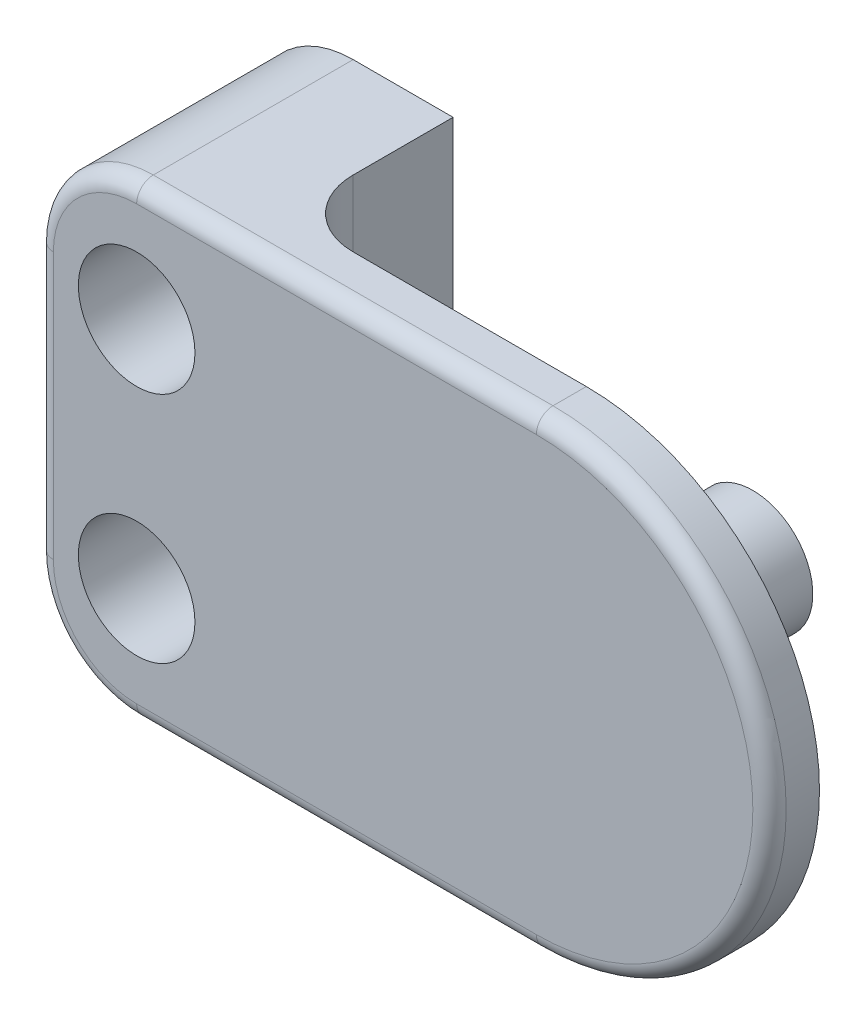
ISO-10303-21;
HEADER;
FILE_DESCRIPTION(('STEP AP214'),'2;1');
FILE_NAME('part.step','',(''),(''),'','','');
FILE_SCHEMA(('AUTOMOTIVE_DESIGN { 1 0 10303 214 1 1 1 1 }'));
ENDSEC;
DATA;
#1=APPLICATION_CONTEXT('core data for automotive mechanical design processes');
#2=APPLICATION_PROTOCOL_DEFINITION('international standard','automotive_design',2000,#1);
#3=PRODUCT_CONTEXT('',#1,'mechanical');
#4=PRODUCT('Part','Part','',(#3));
#5=PRODUCT_RELATED_PRODUCT_CATEGORY('part','',(#4));
#6=PRODUCT_DEFINITION_FORMATION('','',#4);
#7=PRODUCT_DEFINITION_CONTEXT('part definition',#1,'design');
#8=PRODUCT_DEFINITION('design','',#6,#7);
#9=PRODUCT_DEFINITION_SHAPE('','',#8);
#10=(LENGTH_UNIT() NAMED_UNIT(*) SI_UNIT(.MILLI.,.METRE.));
#11=(NAMED_UNIT(*) PLANE_ANGLE_UNIT() SI_UNIT($,.RADIAN.));
#12=(NAMED_UNIT(*) SI_UNIT($,.STERADIAN.) SOLID_ANGLE_UNIT());
#13=UNCERTAINTY_MEASURE_WITH_UNIT(LENGTH_MEASURE(1.E-05),#10,'distance_accuracy_value','');
#14=(GEOMETRIC_REPRESENTATION_CONTEXT(3) GLOBAL_UNCERTAINTY_ASSIGNED_CONTEXT((#13)) GLOBAL_UNIT_ASSIGNED_CONTEXT((#10,
#11,#12)) REPRESENTATION_CONTEXT('',''));
#15=CARTESIAN_POINT('',(0.,0.,0.));
#16=DIRECTION('',(0.,0.,1.));
#17=DIRECTION('',(1.,0.,0.));
#18=AXIS2_PLACEMENT_3D('',#15,#16,#17);
#19=CARTESIAN_POINT('',(-12.,3.5,1.5));
#20=DIRECTION('',(0.,0.,-0.999999999999993));
#21=DIRECTION('',(-1.,0.,0.));
#22=AXIS2_PLACEMENT_3D('',#19,#20,#21);
#23=CYLINDRICAL_SURFACE('',#22,1.1);
#24=CARTESIAN_POINT('',(-12.,3.49999999999999,-4.99999999999996));
#25=DIRECTION('',(0.,0.,-0.999999999999993));
#26=DIRECTION('',(-1.,0.,0.));
#27=AXIS2_PLACEMENT_3D('',#24,#25,#26);
#28=CIRCLE('',#27,1.1);
#29=CARTESIAN_POINT('',(-13.1,3.49999999999999,-4.99999999999996));
#30=VERTEX_POINT('',#29);
#31=EDGE_CURVE('E359',#30,#30,#28,.T.);
#32=ORIENTED_EDGE('',*,*,#31,.T.);
#33=EDGE_LOOP('',(#32));
#34=FACE_BOUND('',#33,.T.);
#35=CARTESIAN_POINT('',(-12.,3.49999999999999,-2.49999999999999));
#36=DIRECTION('',(0.,0.,0.999999999999993));
#37=DIRECTION('',(1.,0.,0.));
#38=AXIS2_PLACEMENT_3D('',#35,#36,#37);
#39=CIRCLE('',#38,1.1);
#40=CARTESIAN_POINT('',(-10.9,3.49999999999999,-2.49999999999999));
#41=VERTEX_POINT('',#40);
#42=EDGE_CURVE('E325',#41,#41,#39,.T.);
#43=ORIENTED_EDGE('',*,*,#42,.T.);
#44=EDGE_LOOP('',(#43));
#45=FACE_BOUND('',#44,.T.);
#46=ADVANCED_FACE('F52',(#34,#45),#23,.F.);
#47=CARTESIAN_POINT('',(-12.,-3.5,1.49999999999997));
#48=DIRECTION('',(0.,0.,-0.999999999999993));
#49=DIRECTION('',(-1.,0.,0.));
#50=AXIS2_PLACEMENT_3D('',#47,#48,#49);
#51=CYLINDRICAL_SURFACE('',#50,1.1);
#52=CARTESIAN_POINT('',(-12.,-3.5,-4.99999999999996));
#53=DIRECTION('',(0.,0.,-0.999999999999993));
#54=DIRECTION('',(-1.,0.,0.));
#55=AXIS2_PLACEMENT_3D('',#52,#53,#54);
#56=CIRCLE('',#55,1.1);
#57=CARTESIAN_POINT('',(-13.1,-3.5,-4.99999999999996));
#58=VERTEX_POINT('',#57);
#59=EDGE_CURVE('E344',#58,#58,#56,.T.);
#60=ORIENTED_EDGE('',*,*,#59,.T.);
#61=EDGE_LOOP('',(#60));
#62=FACE_BOUND('',#61,.T.);
#63=CARTESIAN_POINT('',(-12.,-3.50000000000007,-2.49999999999999));
#64=DIRECTION('',(0.,0.,0.999999999999993));
#65=DIRECTION('',(1.,0.,0.));
#66=AXIS2_PLACEMENT_3D('',#63,#64,#65);
#67=CIRCLE('',#66,1.1);
#68=CARTESIAN_POINT('',(-10.9,-3.50000000000007,-2.49999999999999));
#69=VERTEX_POINT('',#68);
#70=EDGE_CURVE('E345',#69,#69,#67,.T.);
#71=ORIENTED_EDGE('',*,*,#70,.T.);
#72=EDGE_LOOP('',(#71));
#73=FACE_BOUND('',#72,.T.);
#74=ADVANCED_FACE('F458',(#62,#73),#51,.F.);
#75=CARTESIAN_POINT('',(0.,0.,0.));
#76=DIRECTION('',(0.,0.,-0.999999999999993));
#77=DIRECTION('',(-1.,0.,0.));
#78=AXIS2_PLACEMENT_3D('',#75,#76,#77);
#79=PLANE('',#78);
#80=CARTESIAN_POINT('',(0.,0.,0.));
#81=DIRECTION('',(0.,0.,-0.999999999999993));
#82=DIRECTION('',(-1.,0.,0.));
#83=AXIS2_PLACEMENT_3D('',#80,#81,#82);
#84=CIRCLE('',#83,2.5);
#85=CARTESIAN_POINT('',(-2.5,0.,0.));
#86=VERTEX_POINT('',#85);
#87=EDGE_CURVE('E240',#86,#86,#84,.T.);
#88=ORIENTED_EDGE('',*,*,#87,.F.);
#89=EDGE_LOOP('',(#88));
#90=FACE_BOUND('',#89,.T.);
#91=DIRECTION('',(1.,0.,0.));
#92=VECTOR('',#91,1.);
#93=CARTESIAN_POINT('',(-15.,-7.00000000000001,0.));
#94=LINE('',#93,#92);
#95=CARTESIAN_POINT('',(-7.,-6.99999999999999,0.));
#96=VERTEX_POINT('',#95);
#97=CARTESIAN_POINT('',(0.,-7.00000000000005,0.));
#98=VERTEX_POINT('',#97);
#99=EDGE_CURVE('E255',#96,#98,#94,.T.);
#100=ORIENTED_EDGE('',*,*,#99,.F.);
#101=DIRECTION('',(0.,-1.,0.));
#102=VECTOR('',#101,1.);
#103=CARTESIAN_POINT('',(-7.00000000000002,0.,0.));
#104=LINE('',#103,#102);
#105=CARTESIAN_POINT('',(-7.00000000000005,6.99999999999999,0.));
#106=VERTEX_POINT('',#105);
#107=EDGE_CURVE('E71',#96,#106,#104,.F.);
#108=ORIENTED_EDGE('',*,*,#107,.T.);
#109=DIRECTION('',(-1.,0.,0.));
#110=VECTOR('',#109,1.);
#111=CARTESIAN_POINT('',(-15.,6.99999999999998,0.));
#112=LINE('',#111,#110);
#113=CARTESIAN_POINT('',(0.,6.99999999999999,0.));
#114=VERTEX_POINT('',#113);
#115=EDGE_CURVE('E252',#114,#106,#112,.T.);
#116=ORIENTED_EDGE('',*,*,#115,.F.);
#117=CARTESIAN_POINT('',(0.,0.,0.));
#118=DIRECTION('',(0.,0.,0.999999999999993));
#119=DIRECTION('',(-1.,0.,0.));
#120=AXIS2_PLACEMENT_3D('',#117,#118,#119);
#121=CIRCLE('',#120,7.);
#122=EDGE_CURVE('E245',#98,#114,#121,.T.);
#123=ORIENTED_EDGE('',*,*,#122,.F.);
#124=EDGE_LOOP('',(#100,#108,#116,#123));
#125=FACE_BOUND('',#124,.T.);
#126=ADVANCED_FACE('F395',(#90,#125),#79,.T.);
#127=CARTESIAN_POINT('',(0.,0.,1.5));
#128=DIRECTION('',(0.,0.,-0.999999999999993));
#129=DIRECTION('',(-1.,0.,0.));
#130=AXIS2_PLACEMENT_3D('',#127,#128,#129);
#131=PLANE('',#130);
#132=CARTESIAN_POINT('',(-12.,3.5,1.5));
#133=DIRECTION('',(0.,0.,0.999999999999993));
#134=DIRECTION('',(1.,0.,0.));
#135=AXIS2_PLACEMENT_3D('',#132,#133,#134);
#136=CIRCLE('',#135,1.75);
#137=CARTESIAN_POINT('',(-10.25,3.5,1.5));
#138=VERTEX_POINT('',#137);
#139=EDGE_CURVE('E375',#138,#138,#136,.T.);
#140=ORIENTED_EDGE('',*,*,#139,.F.);
#141=EDGE_LOOP('',(#140));
#142=FACE_BOUND('',#141,.T.);
#143=CARTESIAN_POINT('',(-12.,-3.5,1.49999999999997));
#144=DIRECTION('',(0.,0.,0.999999999999993));
#145=DIRECTION('',(1.,0.,0.));
#146=AXIS2_PLACEMENT_3D('',#143,#144,#145);
#147=CIRCLE('',#146,1.75);
#148=CARTESIAN_POINT('',(-10.25,-3.5,1.49999999999997));
#149=VERTEX_POINT('',#148);
#150=EDGE_CURVE('E367',#149,#149,#147,.T.);
#151=ORIENTED_EDGE('',*,*,#150,.F.);
#152=EDGE_LOOP('',(#151));
#153=FACE_BOUND('',#152,.T.);
#154=DIRECTION('',(1.,0.,0.));
#155=VECTOR('',#154,1.);
#156=CARTESIAN_POINT('',(0.,-6.50000000000001,1.49999999999998));
#157=LINE('',#156,#155);
#158=CARTESIAN_POINT('',(-12.,-6.50000000000002,1.5));
#159=VERTEX_POINT('',#158);
#160=CARTESIAN_POINT('',(0.,-6.50000000000001,1.49999999999998));
#161=VERTEX_POINT('',#160);
#162=EDGE_CURVE('E294',#159,#161,#157,.T.);
#163=ORIENTED_EDGE('',*,*,#162,.T.);
#164=CARTESIAN_POINT('',(0.,0.,1.5));
#165=DIRECTION('',(0.,0.,-0.999999999999993));
#166=DIRECTION('',(-1.,0.,0.));
#167=AXIS2_PLACEMENT_3D('',#164,#165,#166);
#168=CIRCLE('',#167,6.5);
#169=CARTESIAN_POINT('',(0.,6.50000000000002,1.5));
#170=VERTEX_POINT('',#169);
#171=EDGE_CURVE('E297',#161,#170,#168,.F.);
#172=ORIENTED_EDGE('',*,*,#171,.T.);
#173=DIRECTION('',(-1.,0.,0.));
#174=VECTOR('',#173,1.);
#175=CARTESIAN_POINT('',(0.,6.50000000000002,1.5));
#176=LINE('',#175,#174);
#177=CARTESIAN_POINT('',(-12.,6.49999999999998,1.5));
#178=VERTEX_POINT('',#177);
#179=EDGE_CURVE('E282',#170,#178,#176,.T.);
#180=ORIENTED_EDGE('',*,*,#179,.T.);
#181=CARTESIAN_POINT('',(-12.0000000000001,3.99999999999999,1.5));
#182=DIRECTION('',(0.,0.,-0.999999999999993));
#183=DIRECTION('',(-1.,0.,0.));
#184=AXIS2_PLACEMENT_3D('',#181,#182,#183);
#185=CIRCLE('',#184,2.5);
#186=CARTESIAN_POINT('',(-14.5,3.99999999999998,1.5));
#187=VERTEX_POINT('',#186);
#188=EDGE_CURVE('E285',#178,#187,#185,.F.);
#189=ORIENTED_EDGE('',*,*,#188,.T.);
#190=DIRECTION('',(0.,-1.,0.));
#191=VECTOR('',#190,1.);
#192=CARTESIAN_POINT('',(-14.5,0.,1.5));
#193=LINE('',#192,#191);
#194=CARTESIAN_POINT('',(-14.5,-4.,1.5));
#195=VERTEX_POINT('',#194);
#196=EDGE_CURVE('E288',#187,#195,#193,.T.);
#197=ORIENTED_EDGE('',*,*,#196,.T.);
#198=CARTESIAN_POINT('',(-12.,-3.99999999999999,1.49999999999998));
#199=DIRECTION('',(0.,0.,-0.999999999999993));
#200=DIRECTION('',(-1.,0.,0.));
#201=AXIS2_PLACEMENT_3D('',#198,#199,#200);
#202=CIRCLE('',#201,2.5);
#203=EDGE_CURVE('E291',#195,#159,#202,.F.);
#204=ORIENTED_EDGE('',*,*,#203,.T.);
#205=EDGE_LOOP('',(#163,#172,#180,#189,#197,#204));
#206=FACE_BOUND('',#205,.T.);
#207=ADVANCED_FACE('F391',(#142,#153,#206),#131,.F.);
#208=CARTESIAN_POINT('',(0.,0.,1.5));
#209=DIRECTION('',(0.,0.,-0.999999999999993));
#210=DIRECTION('',(-1.,0.,0.));
#211=AXIS2_PLACEMENT_3D('',#208,#209,#210);
#212=CYLINDRICAL_SURFACE('',#211,7.);
#213=DIRECTION('',(0.,0.,-0.999999999999993));
#214=VECTOR('',#213,1.);
#215=CARTESIAN_POINT('',(0.,6.99999999999999,1.5));
#216=LINE('',#215,#214);
#217=CARTESIAN_POINT('',(0.,6.99999999999999,0.999999999999999));
#218=VERTEX_POINT('',#217);
#219=EDGE_CURVE('E262',#218,#114,#216,.T.);
#220=ORIENTED_EDGE('',*,*,#219,.F.);
#221=CARTESIAN_POINT('',(0.,0.,0.999999999999999));
#222=DIRECTION('',(0.,0.,-0.999999999999993));
#223=DIRECTION('',(-1.,0.,0.));
#224=AXIS2_PLACEMENT_3D('',#221,#222,#223);
#225=CIRCLE('',#224,7.);
#226=CARTESIAN_POINT('',(0.,-7.00000000000001,0.999999999999999));
#227=VERTEX_POINT('',#226);
#228=EDGE_CURVE('E301',#218,#227,#225,.T.);
#229=ORIENTED_EDGE('',*,*,#228,.T.);
#230=DIRECTION('',(0.,0.,-0.999999999999993));
#231=VECTOR('',#230,1.);
#232=CARTESIAN_POINT('',(0.,-7.00000000000001,1.5));
#233=LINE('',#232,#231);
#234=EDGE_CURVE('E258',#227,#98,#233,.T.);
#235=ORIENTED_EDGE('',*,*,#234,.T.);
#236=ORIENTED_EDGE('',*,*,#122,.T.);
#237=EDGE_LOOP('',(#220,#229,#235,#236));
#238=FACE_BOUND('',#237,.T.);
#239=ADVANCED_FACE('F394',(#238),#212,.T.);
#240=CARTESIAN_POINT('',(-15.,7.00000000000001,1.5));
#241=DIRECTION('',(0.,-1.,0.));
#242=DIRECTION('',(0.,0.,-0.999999999999993));
#243=AXIS2_PLACEMENT_3D('',#240,#241,#242);
#244=PLANE('',#243);
#245=DIRECTION('',(0.,0.,-0.999999999999993));
#246=VECTOR('',#245,1.);
#247=CARTESIAN_POINT('',(-12.,6.99999999999998,1.5));
#248=LINE('',#247,#246);
#249=CARTESIAN_POINT('',(-12.,6.99999999999999,-4.99999999999997));
#250=VERTEX_POINT('',#249);
#251=CARTESIAN_POINT('',(-12.,6.99999999999998,0.999999999999999));
#252=VERTEX_POINT('',#251);
#253=EDGE_CURVE('E276',#250,#252,#248,.F.);
#254=ORIENTED_EDGE('',*,*,#253,.T.);
#255=DIRECTION('',(-1.,0.,0.));
#256=VECTOR('',#255,1.);
#257=CARTESIAN_POINT('',(-15.,7.00000000000001,1.));
#258=LINE('',#257,#256);
#259=EDGE_CURVE('E317',#252,#218,#258,.F.);
#260=ORIENTED_EDGE('',*,*,#259,.T.);
#261=ORIENTED_EDGE('',*,*,#219,.T.);
#262=ORIENTED_EDGE('',*,*,#115,.T.);
#263=CARTESIAN_POINT('',(-7.00000000000002,6.99999999999992,-1.99999999999999));
#264=DIRECTION('',(0.,-1.,0.));
#265=DIRECTION('',(0.,0.,-0.999999999999993));
#266=AXIS2_PLACEMENT_3D('',#263,#264,#265);
#267=CIRCLE('',#266,2.);
#268=CARTESIAN_POINT('',(-9.,6.99999999999996,-1.99999999999999));
#269=VERTEX_POINT('',#268);
#270=EDGE_CURVE('E13',#106,#269,#267,.T.);
#271=ORIENTED_EDGE('',*,*,#270,.T.);
#272=DIRECTION('',(0.,0.,0.999999999999993));
#273=VECTOR('',#272,1.);
#274=CARTESIAN_POINT('',(-9.,6.99999999999996,-4.99999999999996));
#275=LINE('',#274,#273);
#276=CARTESIAN_POINT('',(-9.,6.99999999999996,-4.99999999999996));
#277=VERTEX_POINT('',#276);
#278=EDGE_CURVE('E196',#277,#269,#275,.T.);
#279=ORIENTED_EDGE('',*,*,#278,.F.);
#280=DIRECTION('',(1.,0.,0.));
#281=VECTOR('',#280,1.);
#282=CARTESIAN_POINT('',(-15.,6.99999999999987,-4.99999999999997));
#283=LINE('',#282,#281);
#284=EDGE_CURVE('E178',#250,#277,#283,.T.);
#285=ORIENTED_EDGE('',*,*,#284,.F.);
#286=EDGE_LOOP('',(#254,#260,#261,#262,#271,#279,#285));
#287=FACE_BOUND('',#286,.T.);
#288=ADVANCED_FACE('F197',(#287),#244,.F.);
#289=CARTESIAN_POINT('',(-15.,7.00000000000001,1.5));
#290=DIRECTION('',(1.,0.,0.));
#291=DIRECTION('',(0.,1.,0.));
#292=AXIS2_PLACEMENT_3D('',#289,#290,#291);
#293=PLANE('',#292);
#294=DIRECTION('',(0.,0.,-0.999999999999993));
#295=VECTOR('',#294,1.);
#296=CARTESIAN_POINT('',(-15.,-3.99999999999999,1.5));
#297=LINE('',#296,#295);
#298=CARTESIAN_POINT('',(-15.,-3.99999999999999,-4.99999999999996));
#299=VERTEX_POINT('',#298);
#300=CARTESIAN_POINT('',(-15.,-3.99999999999999,0.999999999999999));
#301=VERTEX_POINT('',#300);
#302=EDGE_CURVE('E265',#299,#301,#297,.F.);
#303=ORIENTED_EDGE('',*,*,#302,.T.);
#304=DIRECTION('',(0.,-1.,0.));
#305=VECTOR('',#304,1.);
#306=CARTESIAN_POINT('',(-15.,7.00000000000001,1.));
#307=LINE('',#306,#305);
#308=CARTESIAN_POINT('',(-15.,4.00000000000002,1.));
#309=VERTEX_POINT('',#308);
#310=EDGE_CURVE('E311',#301,#309,#307,.F.);
#311=ORIENTED_EDGE('',*,*,#310,.T.);
#312=DIRECTION('',(0.,0.,-0.999999999999993));
#313=VECTOR('',#312,1.);
#314=CARTESIAN_POINT('',(-15.,4.00000000000002,1.5));
#315=LINE('',#314,#313);
#316=CARTESIAN_POINT('',(-15.,4.00000000000002,-4.99999999999997));
#317=VERTEX_POINT('',#316);
#318=EDGE_CURVE('E269',#309,#317,#315,.T.);
#319=ORIENTED_EDGE('',*,*,#318,.T.);
#320=DIRECTION('',(0.,1.,0.));
#321=VECTOR('',#320,1.);
#322=CARTESIAN_POINT('',(-15.,6.99999999999987,-4.99999999999997));
#323=LINE('',#322,#321);
#324=EDGE_CURVE('E193',#299,#317,#323,.T.);
#325=ORIENTED_EDGE('',*,*,#324,.F.);
#326=EDGE_LOOP('',(#303,#311,#319,#325));
#327=FACE_BOUND('',#326,.T.);
#328=ADVANCED_FACE('F435',(#327),#293,.F.);
#329=CARTESIAN_POINT('',(-15.,-7.00000000000001,1.5));
#330=DIRECTION('',(0.,1.,0.));
#331=DIRECTION('',(0.,0.,0.999999999999993));
#332=AXIS2_PLACEMENT_3D('',#329,#330,#331);
#333=PLANE('',#332);
#334=ORIENTED_EDGE('',*,*,#234,.F.);
#335=DIRECTION('',(1.,0.,0.));
#336=VECTOR('',#335,1.);
#337=CARTESIAN_POINT('',(-15.,-7.00000000000001,0.999999999999999));
#338=LINE('',#337,#336);
#339=CARTESIAN_POINT('',(-12.,-7.00000000000001,1.));
#340=VERTEX_POINT('',#339);
#341=EDGE_CURVE('E305',#227,#340,#338,.F.);
#342=ORIENTED_EDGE('',*,*,#341,.T.);
#343=DIRECTION('',(0.,0.,-0.999999999999993));
#344=VECTOR('',#343,1.);
#345=CARTESIAN_POINT('',(-12.,-7.00000000000001,1.5));
#346=LINE('',#345,#344);
#347=CARTESIAN_POINT('',(-12.,-7.00000000000005,-4.99999999999997));
#348=VERTEX_POINT('',#347);
#349=EDGE_CURVE('E279',#340,#348,#346,.T.);
#350=ORIENTED_EDGE('',*,*,#349,.T.);
#351=DIRECTION('',(-1.,0.,0.));
#352=VECTOR('',#351,1.);
#353=CARTESIAN_POINT('',(-15.,-7.00000000000001,-4.99999999999997));
#354=LINE('',#353,#352);
#355=CARTESIAN_POINT('',(-9.00000000000004,-7.0000000000001,-4.99999999999997));
#356=VERTEX_POINT('',#355);
#357=EDGE_CURVE('E209',#356,#348,#354,.T.);
#358=ORIENTED_EDGE('',*,*,#357,.F.);
#359=DIRECTION('',(0.,0.,0.999999999999993));
#360=VECTOR('',#359,1.);
#361=CARTESIAN_POINT('',(-9.00000000000004,-7.0000000000001,-4.99999999999997));
#362=LINE('',#361,#360);
#363=CARTESIAN_POINT('',(-9.00000000000004,-7.00000000000009,-2.));
#364=VERTEX_POINT('',#363);
#365=EDGE_CURVE('E204',#356,#364,#362,.T.);
#366=ORIENTED_EDGE('',*,*,#365,.T.);
#367=CARTESIAN_POINT('',(-6.99999999999999,-6.99999999999999,-1.99999999999999));
#368=DIRECTION('',(0.,1.,0.));
#369=DIRECTION('',(0.,0.,0.999999999999993));
#370=AXIS2_PLACEMENT_3D('',#367,#368,#369);
#371=CIRCLE('',#370,2.);
#372=EDGE_CURVE('E61',#364,#96,#371,.T.);
#373=ORIENTED_EDGE('',*,*,#372,.T.);
#374=ORIENTED_EDGE('',*,*,#99,.T.);
#375=EDGE_LOOP('',(#334,#342,#350,#358,#366,#373,#374));
#376=FACE_BOUND('',#375,.T.);
#377=ADVANCED_FACE('F444',(#376),#333,.F.);
#378=CARTESIAN_POINT('',(0.,0.,-0.999999999999999));
#379=DIRECTION('',(0.,0.,0.999999999999993));
#380=DIRECTION('',(1.,0.,0.));
#381=AXIS2_PLACEMENT_3D('',#378,#379,#380);
#382=CYLINDRICAL_SURFACE('',#381,2.5);
#383=CARTESIAN_POINT('',(0.,0.,-0.999999999999999));
#384=DIRECTION('',(0.,0.,-0.999999999999993));
#385=DIRECTION('',(-1.,0.,0.));
#386=AXIS2_PLACEMENT_3D('',#383,#384,#385);
#387=CIRCLE('',#386,2.5);
#388=CARTESIAN_POINT('',(-2.5,0.,-0.999999999999999));
#389=VERTEX_POINT('',#388);
#390=EDGE_CURVE('E241',#389,#389,#387,.T.);
#391=ORIENTED_EDGE('',*,*,#390,.F.);
#392=EDGE_LOOP('',(#391));
#393=FACE_BOUND('',#392,.T.);
#394=ORIENTED_EDGE('',*,*,#87,.T.);
#395=EDGE_LOOP('',(#394));
#396=FACE_BOUND('',#395,.T.);
#397=ADVANCED_FACE('F446',(#393,#396),#382,.T.);
#398=CARTESIAN_POINT('',(0.,0.,-0.999999999999999));
#399=DIRECTION('',(0.,0.,-0.999999999999993));
#400=DIRECTION('',(-1.,0.,0.));
#401=AXIS2_PLACEMENT_3D('',#398,#399,#400);
#402=PLANE('',#401);
#403=CARTESIAN_POINT('',(0.,0.,-0.999999999999999));
#404=DIRECTION('',(0.,0.,-0.999999999999993));
#405=DIRECTION('',(-1.,0.,0.));
#406=AXIS2_PLACEMENT_3D('',#403,#404,#405);
#407=CIRCLE('',#406,1.8);
#408=CARTESIAN_POINT('',(-1.13862177025649,1.39410920099466,-1.));
#409=VERTEX_POINT('',#408);
#410=CARTESIAN_POINT('',(-1.13862177025649,-1.39410920099467,-1.));
#411=VERTEX_POINT('',#410);
#412=EDGE_CURVE('E203',#409,#411,#407,.T.);
#413=ORIENTED_EDGE('',*,*,#412,.F.);
#414=DIRECTION('',(0.,1.,0.));
#415=VECTOR('',#414,1.);
#416=CARTESIAN_POINT('',(-1.13862177025649,1.39410920099466,-1.));
#417=LINE('',#416,#415);
#418=EDGE_CURVE('E223',#411,#409,#417,.T.);
#419=ORIENTED_EDGE('',*,*,#418,.F.);
#420=EDGE_LOOP('',(#413,#419));
#421=FACE_BOUND('',#420,.T.);
#422=ORIENTED_EDGE('',*,*,#390,.T.);
#423=EDGE_LOOP('',(#422));
#424=FACE_BOUND('',#423,.T.);
#425=ADVANCED_FACE('F452',(#421,#424),#402,.T.);
#426=CARTESIAN_POINT('',(0.,0.,-4.99999999999997));
#427=DIRECTION('',(0.,0.,0.999999999999993));
#428=DIRECTION('',(1.,0.,0.));
#429=AXIS2_PLACEMENT_3D('',#426,#427,#428);
#430=CYLINDRICAL_SURFACE('',#429,1.8);
#431=ORIENTED_EDGE('',*,*,#412,.T.);
#432=DIRECTION('',(0.,0.,0.999999999999993));
#433=VECTOR('',#432,1.);
#434=CARTESIAN_POINT('',(-1.13862177025649,-1.39410920099467,-4.99999999999997));
#435=LINE('',#434,#433);
#436=CARTESIAN_POINT('',(-1.13862177025649,-1.39410920099467,-4.99999999999997));
#437=VERTEX_POINT('',#436);
#438=EDGE_CURVE('E236',#437,#411,#435,.T.);
#439=ORIENTED_EDGE('',*,*,#438,.F.);
#440=CARTESIAN_POINT('',(0.,0.,-4.99999999999997));
#441=DIRECTION('',(0.,0.,-0.999999999999993));
#442=DIRECTION('',(-1.,0.,0.));
#443=AXIS2_PLACEMENT_3D('',#440,#441,#442);
#444=CIRCLE('',#443,1.8);
#445=CARTESIAN_POINT('',(-1.13862177025649,1.39410920099466,-4.99999999999996));
#446=VERTEX_POINT('',#445);
#447=EDGE_CURVE('E218',#446,#437,#444,.T.);
#448=ORIENTED_EDGE('',*,*,#447,.F.);
#449=DIRECTION('',(0.,0.,0.999999999999993));
#450=VECTOR('',#449,1.);
#451=CARTESIAN_POINT('',(-1.13862177025649,1.39410920099466,-4.99999999999996));
#452=LINE('',#451,#450);
#453=EDGE_CURVE('E226',#446,#409,#452,.T.);
#454=ORIENTED_EDGE('',*,*,#453,.T.);
#455=EDGE_LOOP('',(#431,#439,#448,#454));
#456=FACE_BOUND('',#455,.T.);
#457=ADVANCED_FACE('F518',(#456),#430,.T.);
#458=CARTESIAN_POINT('',(-1.13862177025649,1.39410920099466,-4.99999999999996));
#459=DIRECTION('',(1.,0.,0.));
#460=DIRECTION('',(0.,0.,-0.999999999999993));
#461=AXIS2_PLACEMENT_3D('',#458,#459,#460);
#462=PLANE('',#461);
#463=ORIENTED_EDGE('',*,*,#418,.T.);
#464=ORIENTED_EDGE('',*,*,#453,.F.);
#465=DIRECTION('',(0.,1.,0.));
#466=VECTOR('',#465,1.);
#467=CARTESIAN_POINT('',(-1.13862177025649,1.39410920099466,-4.99999999999996));
#468=LINE('',#467,#466);
#469=EDGE_CURVE('E222',#437,#446,#468,.T.);
#470=ORIENTED_EDGE('',*,*,#469,.F.);
#471=ORIENTED_EDGE('',*,*,#438,.T.);
#472=EDGE_LOOP('',(#463,#464,#470,#471));
#473=FACE_BOUND('',#472,.T.);
#474=ADVANCED_FACE('F527',(#473),#462,.F.);
#475=CARTESIAN_POINT('',(0.,0.,-4.99999999999997));
#476=DIRECTION('',(0.,0.,-0.999999999999993));
#477=DIRECTION('',(-1.,0.,0.));
#478=AXIS2_PLACEMENT_3D('',#475,#476,#477);
#479=PLANE('',#478);
#480=ORIENTED_EDGE('',*,*,#447,.T.);
#481=ORIENTED_EDGE('',*,*,#469,.T.);
#482=EDGE_LOOP('',(#480,#481));
#483=FACE_BOUND('',#482,.T.);
#484=ADVANCED_FACE('F537',(#483),#479,.T.);
#485=CARTESIAN_POINT('',(0.,0.,-4.99999999999997));
#486=DIRECTION('',(0.,0.,0.999999999999993));
#487=DIRECTION('',(1.,0.,0.));
#488=AXIS2_PLACEMENT_3D('',#485,#486,#487);
#489=PLANE('',#488);
#490=ORIENTED_EDGE('',*,*,#324,.T.);
#491=CARTESIAN_POINT('',(-12.,3.99999999999998,-4.99999999999996));
#492=DIRECTION('',(0.,0.,0.999999999999993));
#493=DIRECTION('',(1.,0.,0.));
#494=AXIS2_PLACEMENT_3D('',#491,#492,#493);
#495=CIRCLE('',#494,3.);
#496=EDGE_CURVE('E188',#317,#250,#495,.F.);
#497=ORIENTED_EDGE('',*,*,#496,.T.);
#498=ORIENTED_EDGE('',*,*,#284,.T.);
#499=DIRECTION('',(0.,-1.,0.));
#500=VECTOR('',#499,1.);
#501=CARTESIAN_POINT('',(-9.,6.99999999999996,-4.99999999999996));
#502=LINE('',#501,#500);
#503=EDGE_CURVE('E185',#277,#356,#502,.T.);
#504=ORIENTED_EDGE('',*,*,#503,.T.);
#505=ORIENTED_EDGE('',*,*,#357,.T.);
#506=CARTESIAN_POINT('',(-12.,-3.99999999999999,-4.99999999999996));
#507=DIRECTION('',(0.,0.,0.999999999999993));
#508=DIRECTION('',(1.,0.,0.));
#509=AXIS2_PLACEMENT_3D('',#506,#507,#508);
#510=CIRCLE('',#509,3.);
#511=EDGE_CURVE('E272',#348,#299,#510,.F.);
#512=ORIENTED_EDGE('',*,*,#511,.T.);
#513=EDGE_LOOP('',(#490,#497,#498,#504,#505,#512));
#514=FACE_BOUND('',#513,.T.);
#515=ORIENTED_EDGE('',*,*,#31,.F.);
#516=EDGE_LOOP('',(#515));
#517=FACE_BOUND('',#516,.T.);
#518=ORIENTED_EDGE('',*,*,#59,.F.);
#519=EDGE_LOOP('',(#518));
#520=FACE_BOUND('',#519,.T.);
#521=ADVANCED_FACE('F181',(#514,#517,#520),#489,.F.);
#522=CARTESIAN_POINT('',(-9.,6.99999999999996,-4.99999999999996));
#523=DIRECTION('',(-1.,0.,0.));
#524=DIRECTION('',(0.,-1.,0.));
#525=AXIS2_PLACEMENT_3D('',#522,#523,#524);
#526=PLANE('',#525);
#527=ORIENTED_EDGE('',*,*,#278,.T.);
#528=DIRECTION('',(0.,-1.,0.));
#529=VECTOR('',#528,1.);
#530=CARTESIAN_POINT('',(-9.,6.99999999999996,-1.99999999999999));
#531=LINE('',#530,#529);
#532=EDGE_CURVE('E320',#269,#364,#531,.T.);
#533=ORIENTED_EDGE('',*,*,#532,.T.);
#534=ORIENTED_EDGE('',*,*,#365,.F.);
#535=ORIENTED_EDGE('',*,*,#503,.F.);
#536=EDGE_LOOP('',(#527,#533,#534,#535));
#537=FACE_BOUND('',#536,.T.);
#538=ADVANCED_FACE('F206',(#537),#526,.F.);
#539=CARTESIAN_POINT('',(-12.0000000000001,3.99999999999999,1.5));
#540=DIRECTION('',(0.,0.,-0.999999999999993));
#541=DIRECTION('',(-1.,0.,0.));
#542=AXIS2_PLACEMENT_3D('',#539,#540,#541);
#543=CYLINDRICAL_SURFACE('',#542,3.);
#544=ORIENTED_EDGE('',*,*,#318,.F.);
#545=CARTESIAN_POINT('',(-12.0000000000001,3.99999999999999,1.));
#546=DIRECTION('',(0.,0.,-0.999999999999993));
#547=DIRECTION('',(-1.,0.,0.));
#548=AXIS2_PLACEMENT_3D('',#545,#546,#547);
#549=CIRCLE('',#548,3.);
#550=EDGE_CURVE('E314',#309,#252,#549,.T.);
#551=ORIENTED_EDGE('',*,*,#550,.T.);
#552=ORIENTED_EDGE('',*,*,#253,.F.);
#553=ORIENTED_EDGE('',*,*,#496,.F.);
#554=EDGE_LOOP('',(#544,#551,#552,#553));
#555=FACE_BOUND('',#554,.T.);
#556=ADVANCED_FACE('F438',(#555),#543,.T.);
#557=CARTESIAN_POINT('',(-12.,-3.99999999999999,1.49999999999998));
#558=DIRECTION('',(0.,0.,-0.999999999999993));
#559=DIRECTION('',(-1.,0.,0.));
#560=AXIS2_PLACEMENT_3D('',#557,#558,#559);
#561=CYLINDRICAL_SURFACE('',#560,3.);
#562=ORIENTED_EDGE('',*,*,#349,.F.);
#563=CARTESIAN_POINT('',(-12.,-3.99999999999999,0.999999999999999));
#564=DIRECTION('',(0.,0.,-0.999999999999993));
#565=DIRECTION('',(-1.,0.,0.));
#566=AXIS2_PLACEMENT_3D('',#563,#564,#565);
#567=CIRCLE('',#566,3.);
#568=EDGE_CURVE('E308',#340,#301,#567,.T.);
#569=ORIENTED_EDGE('',*,*,#568,.T.);
#570=ORIENTED_EDGE('',*,*,#302,.F.);
#571=ORIENTED_EDGE('',*,*,#511,.F.);
#572=EDGE_LOOP('',(#562,#569,#570,#571));
#573=FACE_BOUND('',#572,.T.);
#574=ADVANCED_FACE('F432',(#573),#561,.T.);
#575=CARTESIAN_POINT('',(-14.5,0.,0.999999999999999));
#576=DIRECTION('',(0.,-1.,0.));
#577=DIRECTION('',(1.,0.,0.));
#578=AXIS2_PLACEMENT_3D('',#575,#576,#577);
#579=CYLINDRICAL_SURFACE('',#578,0.5);
#580=CARTESIAN_POINT('',(-14.5,3.99999999999998,0.999999999999999));
#581=DIRECTION('',(0.,1.,0.));
#582=DIRECTION('',(0.,0.,0.999999999999993));
#583=AXIS2_PLACEMENT_3D('',#580,#581,#582);
#584=CIRCLE('',#583,0.5);
#585=EDGE_CURVE('E336',#309,#187,#584,.T.);
#586=ORIENTED_EDGE('',*,*,#585,.F.);
#587=ORIENTED_EDGE('',*,*,#310,.F.);
#588=CARTESIAN_POINT('',(-14.5,-4.,0.999999999999999));
#589=DIRECTION('',(0.,-1.,0.));
#590=DIRECTION('',(0.,0.,-0.999999999999993));
#591=AXIS2_PLACEMENT_3D('',#588,#589,#590);
#592=CIRCLE('',#591,0.5);
#593=EDGE_CURVE('E340',#195,#301,#592,.T.);
#594=ORIENTED_EDGE('',*,*,#593,.F.);
#595=ORIENTED_EDGE('',*,*,#196,.F.);
#596=EDGE_LOOP('',(#586,#587,#594,#595));
#597=FACE_BOUND('',#596,.T.);
#598=ADVANCED_FACE('F424',(#597),#579,.T.);
#599=CARTESIAN_POINT('',(-12.,-3.99999999999999,0.999999999999999));
#600=DIRECTION('',(0.,0.,-0.999999999999993));
#601=DIRECTION('',(-1.,0.,0.));
#602=AXIS2_PLACEMENT_3D('',#599,#600,#601);
#603=TOROIDAL_SURFACE('',#602,2.5,0.5);
#604=ORIENTED_EDGE('',*,*,#593,.T.);
#605=ORIENTED_EDGE('',*,*,#568,.F.);
#606=CARTESIAN_POINT('',(-12.,-6.50000000000002,1.00000000000001));
#607=DIRECTION('',(1.,0.,0.));
#608=DIRECTION('',(0.,0.,-0.999999999999993));
#609=AXIS2_PLACEMENT_3D('',#606,#607,#608);
#610=CIRCLE('',#609,0.5);
#611=EDGE_CURVE('E332',#159,#340,#610,.T.);
#612=ORIENTED_EDGE('',*,*,#611,.F.);
#613=ORIENTED_EDGE('',*,*,#203,.F.);
#614=EDGE_LOOP('',(#604,#605,#612,#613));
#615=FACE_BOUND('',#614,.T.);
#616=ADVANCED_FACE('F428',(#615),#603,.T.);
#617=CARTESIAN_POINT('',(-12.0000000000001,3.99999999999999,1.));
#618=DIRECTION('',(0.,0.,-0.999999999999993));
#619=DIRECTION('',(-1.,0.,0.));
#620=AXIS2_PLACEMENT_3D('',#617,#618,#619);
#621=TOROIDAL_SURFACE('',#620,2.5,0.5);
#622=ORIENTED_EDGE('',*,*,#585,.T.);
#623=ORIENTED_EDGE('',*,*,#188,.F.);
#624=CARTESIAN_POINT('',(-12.0000000000001,6.49999999999995,0.999999999999999));
#625=DIRECTION('',(1.,0.,0.));
#626=DIRECTION('',(0.,0.,-0.999999999999993));
#627=AXIS2_PLACEMENT_3D('',#624,#625,#626);
#628=CIRCLE('',#627,0.5);
#629=EDGE_CURVE('E328',#252,#178,#628,.T.);
#630=ORIENTED_EDGE('',*,*,#629,.F.);
#631=ORIENTED_EDGE('',*,*,#550,.F.);
#632=EDGE_LOOP('',(#622,#623,#630,#631));
#633=FACE_BOUND('',#632,.T.);
#634=ADVANCED_FACE('F419',(#633),#621,.T.);
#635=CARTESIAN_POINT('',(0.,-6.50000000000001,0.999999999999999));
#636=DIRECTION('',(1.,0.,0.));
#637=DIRECTION('',(0.,0.,-0.999999999999993));
#638=AXIS2_PLACEMENT_3D('',#635,#636,#637);
#639=CYLINDRICAL_SURFACE('',#638,0.5);
#640=ORIENTED_EDGE('',*,*,#611,.T.);
#641=ORIENTED_EDGE('',*,*,#341,.F.);
#642=CARTESIAN_POINT('',(0.,-6.50000000000001,0.999999999999999));
#643=DIRECTION('',(1.,0.,0.));
#644=DIRECTION('',(0.,0.,-0.999999999999993));
#645=AXIS2_PLACEMENT_3D('',#642,#643,#644);
#646=CIRCLE('',#645,0.5);
#647=EDGE_CURVE('E324',#161,#227,#646,.T.);
#648=ORIENTED_EDGE('',*,*,#647,.F.);
#649=ORIENTED_EDGE('',*,*,#162,.F.);
#650=EDGE_LOOP('',(#640,#641,#648,#649));
#651=FACE_BOUND('',#650,.T.);
#652=ADVANCED_FACE('F406',(#651),#639,.T.);
#653=CARTESIAN_POINT('',(0.,6.50000000000002,0.999999999999999));
#654=DIRECTION('',(-1.,0.,0.));
#655=DIRECTION('',(0.,0.,0.999999999999993));
#656=AXIS2_PLACEMENT_3D('',#653,#654,#655);
#657=CYLINDRICAL_SURFACE('',#656,0.5);
#658=ORIENTED_EDGE('',*,*,#629,.T.);
#659=ORIENTED_EDGE('',*,*,#179,.F.);
#660=CARTESIAN_POINT('',(0.,6.50000000000002,0.999999999999999));
#661=DIRECTION('',(1.,0.,0.));
#662=DIRECTION('',(0.,0.,-0.999999999999993));
#663=AXIS2_PLACEMENT_3D('',#660,#661,#662);
#664=CIRCLE('',#663,0.5);
#665=EDGE_CURVE('E321',#218,#170,#664,.T.);
#666=ORIENTED_EDGE('',*,*,#665,.F.);
#667=ORIENTED_EDGE('',*,*,#259,.F.);
#668=EDGE_LOOP('',(#658,#659,#666,#667));
#669=FACE_BOUND('',#668,.T.);
#670=ADVANCED_FACE('F414',(#669),#657,.T.);
#671=CARTESIAN_POINT('',(0.,0.,0.999999999999999));
#672=DIRECTION('',(0.,0.,-0.999999999999993));
#673=DIRECTION('',(-1.,0.,0.));
#674=AXIS2_PLACEMENT_3D('',#671,#672,#673);
#675=TOROIDAL_SURFACE('',#674,6.5,0.5);
#676=ORIENTED_EDGE('',*,*,#647,.T.);
#677=ORIENTED_EDGE('',*,*,#228,.F.);
#678=ORIENTED_EDGE('',*,*,#665,.T.);
#679=ORIENTED_EDGE('',*,*,#171,.F.);
#680=EDGE_LOOP('',(#676,#677,#678,#679));
#681=FACE_BOUND('',#680,.T.);
#682=ADVANCED_FACE('F409',(#681),#675,.T.);
#683=CARTESIAN_POINT('',(-12.,-3.50000000000007,-2.49999999999999));
#684=DIRECTION('',(0.,0.,0.999999999999993));
#685=DIRECTION('',(1.,0.,0.));
#686=AXIS2_PLACEMENT_3D('',#683,#684,#685);
#687=CYLINDRICAL_SURFACE('',#686,1.75);
#688=CARTESIAN_POINT('',(-12.,-3.50000000000007,-2.49999999999999));
#689=DIRECTION('',(0.,0.,0.999999999999993));
#690=DIRECTION('',(1.,0.,0.));
#691=AXIS2_PLACEMENT_3D('',#688,#689,#690);
#692=CIRCLE('',#691,1.75);
#693=CARTESIAN_POINT('',(-10.25,-3.50000000000007,-2.49999999999999));
#694=VERTEX_POINT('',#693);
#695=EDGE_CURVE('E371',#694,#694,#692,.T.);
#696=ORIENTED_EDGE('',*,*,#695,.F.);
#697=EDGE_LOOP('',(#696));
#698=FACE_BOUND('',#697,.T.);
#699=ORIENTED_EDGE('',*,*,#150,.T.);
#700=EDGE_LOOP('',(#699));
#701=FACE_BOUND('',#700,.T.);
#702=ADVANCED_FACE('F627',(#698,#701),#687,.F.);
#703=CARTESIAN_POINT('',(-12.,-3.50000000000007,-2.49999999999999));
#704=DIRECTION('',(0.,0.,0.999999999999993));
#705=DIRECTION('',(1.,0.,0.));
#706=AXIS2_PLACEMENT_3D('',#703,#704,#705);
#707=PLANE('',#706);
#708=ORIENTED_EDGE('',*,*,#70,.F.);
#709=EDGE_LOOP('',(#708));
#710=FACE_BOUND('',#709,.T.);
#711=ORIENTED_EDGE('',*,*,#695,.T.);
#712=EDGE_LOOP('',(#711));
#713=FACE_BOUND('',#712,.T.);
#714=ADVANCED_FACE('F387',(#710,#713),#707,.T.);
#715=CARTESIAN_POINT('',(-12.,3.49999999999999,-2.49999999999999));
#716=DIRECTION('',(0.,0.,0.999999999999993));
#717=DIRECTION('',(1.,0.,0.));
#718=AXIS2_PLACEMENT_3D('',#715,#716,#717);
#719=CYLINDRICAL_SURFACE('',#718,1.75);
#720=CARTESIAN_POINT('',(-12.,3.49999999999999,-2.49999999999999));
#721=DIRECTION('',(0.,0.,0.999999999999993));
#722=DIRECTION('',(1.,0.,0.));
#723=AXIS2_PLACEMENT_3D('',#720,#721,#722);
#724=CIRCLE('',#723,1.75);
#725=CARTESIAN_POINT('',(-10.25,3.49999999999999,-2.49999999999999));
#726=VERTEX_POINT('',#725);
#727=EDGE_CURVE('E349',#726,#726,#724,.T.);
#728=ORIENTED_EDGE('',*,*,#727,.F.);
#729=EDGE_LOOP('',(#728));
#730=FACE_BOUND('',#729,.T.);
#731=ORIENTED_EDGE('',*,*,#139,.T.);
#732=EDGE_LOOP('',(#731));
#733=FACE_BOUND('',#732,.T.);
#734=ADVANCED_FACE('F384',(#730,#733),#719,.F.);
#735=CARTESIAN_POINT('',(-12.,3.49999999999999,-2.49999999999999));
#736=DIRECTION('',(0.,0.,0.999999999999993));
#737=DIRECTION('',(1.,0.,0.));
#738=AXIS2_PLACEMENT_3D('',#735,#736,#737);
#739=PLANE('',#738);
#740=ORIENTED_EDGE('',*,*,#42,.F.);
#741=EDGE_LOOP('',(#740));
#742=FACE_BOUND('',#741,.T.);
#743=ORIENTED_EDGE('',*,*,#727,.T.);
#744=EDGE_LOOP('',(#743));
#745=FACE_BOUND('',#744,.T.);
#746=ADVANCED_FACE('F382',(#742,#745),#739,.T.);
#747=CARTESIAN_POINT('',(-7.00000000000002,6.99999999999992,-1.99999999999999));
#748=DIRECTION('',(0.,-1.,0.));
#749=DIRECTION('',(1.,0.,0.));
#750=AXIS2_PLACEMENT_3D('',#747,#748,#749);
#751=CYLINDRICAL_SURFACE('',#750,2.);
#752=ORIENTED_EDGE('',*,*,#270,.F.);
#753=ORIENTED_EDGE('',*,*,#107,.F.);
#754=ORIENTED_EDGE('',*,*,#372,.F.);
#755=ORIENTED_EDGE('',*,*,#532,.F.);
#756=EDGE_LOOP('',(#752,#753,#754,#755));
#757=FACE_BOUND('',#756,.T.);
#758=ADVANCED_FACE('F54',(#757),#751,.F.);
#759=CLOSED_SHELL('',(#46,#74,#126,#207,#239,#288,#328,#377,#397,#425,#457,#474,#484,#521,#538,
#556,#574,#598,#616,#634,#652,#670,#682,#702,#714,#734,#746,#758));
#760=MANIFOLD_SOLID_BREP('B2',#759);
#761=ADVANCED_BREP_SHAPE_REPRESENTATION('',(#18,#760),#14);
#762=SHAPE_DEFINITION_REPRESENTATION(#9,#761);
ENDSEC;
END-ISO-10303-21;
